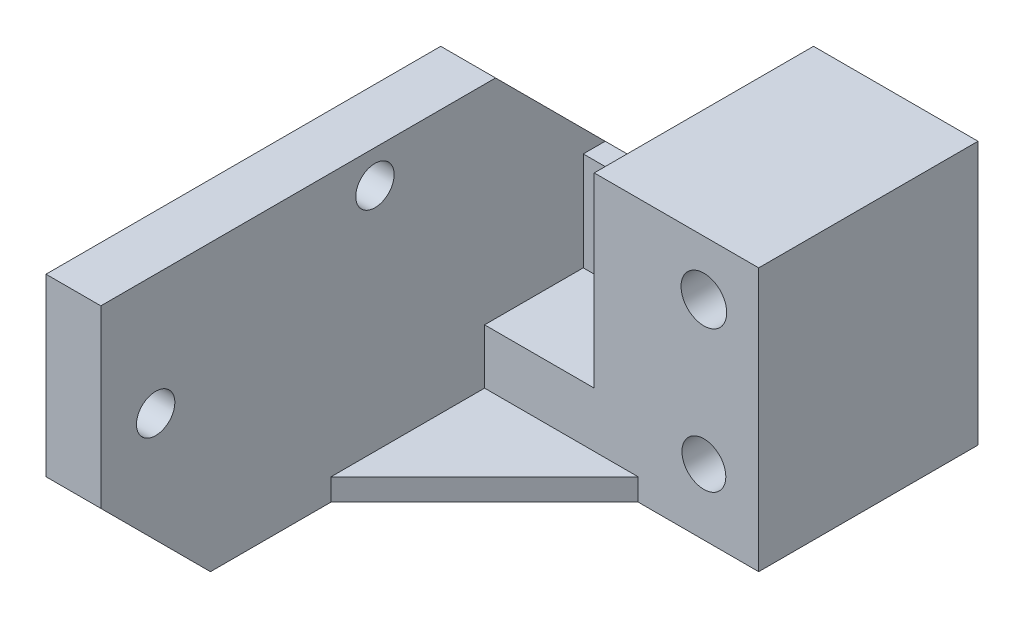
ISO-10303-21;
HEADER;
FILE_DESCRIPTION(('STEP AP214'),'2;1');
FILE_NAME('part.step','',(''),(''),'','','');
FILE_SCHEMA(('AUTOMOTIVE_DESIGN { 1 0 10303 214 1 1 1 1 }'));
ENDSEC;
DATA;
#1=APPLICATION_CONTEXT('core data for automotive mechanical design processes');
#2=APPLICATION_PROTOCOL_DEFINITION('international standard','automotive_design',2000,#1);
#3=PRODUCT_CONTEXT('',#1,'mechanical');
#4=PRODUCT('Part','Part','',(#3));
#5=PRODUCT_RELATED_PRODUCT_CATEGORY('part','',(#4));
#6=PRODUCT_DEFINITION_FORMATION('','',#4);
#7=PRODUCT_DEFINITION_CONTEXT('part definition',#1,'design');
#8=PRODUCT_DEFINITION('design','',#6,#7);
#9=PRODUCT_DEFINITION_SHAPE('','',#8);
#10=(LENGTH_UNIT() NAMED_UNIT(*) SI_UNIT(.MILLI.,.METRE.));
#11=(NAMED_UNIT(*) PLANE_ANGLE_UNIT() SI_UNIT($,.RADIAN.));
#12=(NAMED_UNIT(*) SI_UNIT($,.STERADIAN.) SOLID_ANGLE_UNIT());
#13=UNCERTAINTY_MEASURE_WITH_UNIT(LENGTH_MEASURE(1.E-05),#10,'distance_accuracy_value','');
#14=(GEOMETRIC_REPRESENTATION_CONTEXT(3) GLOBAL_UNCERTAINTY_ASSIGNED_CONTEXT((#13)) GLOBAL_UNIT_ASSIGNED_CONTEXT((#10,
#11,#12)) REPRESENTATION_CONTEXT('',''));
#15=CARTESIAN_POINT('',(0.,0.,0.));
#16=DIRECTION('',(0.,0.,1.));
#17=DIRECTION('',(1.,0.,0.));
#18=AXIS2_PLACEMENT_3D('',#15,#16,#17);
#19=CARTESIAN_POINT('',(30.,12.,0.));
#20=DIRECTION('',(0.,0.,-1.));
#21=DIRECTION('',(-1.,0.,0.));
#22=AXIS2_PLACEMENT_3D('',#19,#20,#21);
#23=PLANE('',#22);
#24=CARTESIAN_POINT('',(25.,19.,0.));
#25=DIRECTION('',(0.,0.,1.));
#26=DIRECTION('',(1.,0.,0.));
#27=AXIS2_PLACEMENT_3D('',#24,#25,#26);
#28=CIRCLE('',#27,2.08412794298633);
#29=CARTESIAN_POINT('',(27.0841279429863,19.,0.));
#30=VERTEX_POINT('',#29);
#31=EDGE_CURVE('E175',#30,#30,#28,.T.);
#32=ORIENTED_EDGE('',*,*,#31,.F.);
#33=EDGE_LOOP('',(#32));
#34=FACE_BOUND('',#33,.T.);
#35=CARTESIAN_POINT('',(25.,6.,0.));
#36=DIRECTION('',(0.,0.,1.));
#37=DIRECTION('',(1.,0.,0.));
#38=AXIS2_PLACEMENT_3D('',#35,#36,#37);
#39=CIRCLE('',#38,2.);
#40=CARTESIAN_POINT('',(27.,6.,0.));
#41=VERTEX_POINT('',#40);
#42=EDGE_CURVE('E183',#41,#41,#39,.T.);
#43=ORIENTED_EDGE('',*,*,#42,.F.);
#44=EDGE_LOOP('',(#43));
#45=FACE_BOUND('',#44,.T.);
#46=DIRECTION('',(0.,-1.,0.));
#47=VECTOR('',#46,1.);
#48=CARTESIAN_POINT('',(15.,24.,0.));
#49=LINE('',#48,#47);
#50=CARTESIAN_POINT('',(15.,24.,0.));
#51=VERTEX_POINT('',#50);
#52=CARTESIAN_POINT('',(15.,7.,0.));
#53=VERTEX_POINT('',#52);
#54=EDGE_CURVE('E174',#51,#53,#49,.T.);
#55=ORIENTED_EDGE('',*,*,#54,.T.);
#56=DIRECTION('',(-1.,0.,0.));
#57=VECTOR('',#56,1.);
#58=CARTESIAN_POINT('',(30.,7.,0.));
#59=LINE('',#58,#57);
#60=CARTESIAN_POINT('',(5.,7.,0.));
#61=VERTEX_POINT('',#60);
#62=EDGE_CURVE('E160',#53,#61,#59,.T.);
#63=ORIENTED_EDGE('',*,*,#62,.T.);
#64=DIRECTION('',(0.,-1.,0.));
#65=VECTOR('',#64,1.);
#66=CARTESIAN_POINT('',(5.,12.,0.));
#67=LINE('',#66,#65);
#68=CARTESIAN_POINT('',(5.,2.,0.));
#69=VERTEX_POINT('',#68);
#70=EDGE_CURVE('E171',#61,#69,#67,.T.);
#71=ORIENTED_EDGE('',*,*,#70,.T.);
#72=DIRECTION('',(1.,0.,0.));
#73=VECTOR('',#72,1.);
#74=CARTESIAN_POINT('',(19.,2.,0.));
#75=LINE('',#74,#73);
#76=CARTESIAN_POINT('',(19.,2.,0.));
#77=VERTEX_POINT('',#76);
#78=EDGE_CURVE('E291',#69,#77,#75,.T.);
#79=ORIENTED_EDGE('',*,*,#78,.T.);
#80=DIRECTION('',(0.,-1.,0.));
#81=VECTOR('',#80,1.);
#82=CARTESIAN_POINT('',(19.,2.,0.));
#83=LINE('',#82,#81);
#84=CARTESIAN_POINT('',(19.,0.,0.));
#85=VERTEX_POINT('',#84);
#86=EDGE_CURVE('E296',#77,#85,#83,.T.);
#87=ORIENTED_EDGE('',*,*,#86,.T.);
#88=DIRECTION('',(1.,0.,0.));
#89=VECTOR('',#88,1.);
#90=CARTESIAN_POINT('',(30.,0.,0.));
#91=LINE('',#90,#89);
#92=CARTESIAN_POINT('',(30.,0.,0.));
#93=VERTEX_POINT('',#92);
#94=EDGE_CURVE('E196',#85,#93,#91,.T.);
#95=ORIENTED_EDGE('',*,*,#94,.T.);
#96=DIRECTION('',(0.,-1.,0.));
#97=VECTOR('',#96,1.);
#98=CARTESIAN_POINT('',(30.,12.,0.));
#99=LINE('',#98,#97);
#100=CARTESIAN_POINT('',(30.,24.,0.));
#101=VERTEX_POINT('',#100);
#102=EDGE_CURVE('E212',#101,#93,#99,.T.);
#103=ORIENTED_EDGE('',*,*,#102,.F.);
#104=DIRECTION('',(1.,0.,0.));
#105=VECTOR('',#104,1.);
#106=CARTESIAN_POINT('',(15.,24.,0.));
#107=LINE('',#106,#105);
#108=EDGE_CURVE('E279',#51,#101,#107,.T.);
#109=ORIENTED_EDGE('',*,*,#108,.F.);
#110=EDGE_LOOP('',(#55,#63,#71,#79,#87,#95,#103,#109));
#111=FACE_BOUND('',#110,.T.);
#112=ADVANCED_FACE('F35',(#34,#45,#111),#23,.F.);
#113=CARTESIAN_POINT('',(30.,12.,-20.));
#114=DIRECTION('',(-1.,0.,0.));
#115=DIRECTION('',(0.,0.,1.));
#116=AXIS2_PLACEMENT_3D('',#113,#114,#115);
#117=PLANE('',#116);
#118=DIRECTION('',(0.,0.,-1.));
#119=VECTOR('',#118,1.);
#120=CARTESIAN_POINT('',(30.,0.,-20.));
#121=LINE('',#120,#119);
#122=CARTESIAN_POINT('',(30.,0.,-20.));
#123=VERTEX_POINT('',#122);
#124=EDGE_CURVE('E198',#93,#123,#121,.T.);
#125=ORIENTED_EDGE('',*,*,#124,.T.);
#126=DIRECTION('',(0.,-1.,0.));
#127=VECTOR('',#126,1.);
#128=CARTESIAN_POINT('',(30.,12.,-20.));
#129=LINE('',#128,#127);
#130=CARTESIAN_POINT('',(30.,24.,-20.));
#131=VERTEX_POINT('',#130);
#132=EDGE_CURVE('E209',#131,#123,#129,.T.);
#133=ORIENTED_EDGE('',*,*,#132,.F.);
#134=DIRECTION('',(0.,0.,-1.));
#135=VECTOR('',#134,1.);
#136=CARTESIAN_POINT('',(30.,24.,-20.));
#137=LINE('',#136,#135);
#138=EDGE_CURVE('E282',#101,#131,#137,.T.);
#139=ORIENTED_EDGE('',*,*,#138,.F.);
#140=ORIENTED_EDGE('',*,*,#102,.T.);
#141=EDGE_LOOP('',(#125,#133,#139,#140));
#142=FACE_BOUND('',#141,.T.);
#143=ADVANCED_FACE('F366',(#142),#117,.F.);
#144=CARTESIAN_POINT('',(15.,12.,-20.));
#145=DIRECTION('',(0.,0.,1.));
#146=DIRECTION('',(1.,0.,0.));
#147=AXIS2_PLACEMENT_3D('',#144,#145,#146);
#148=PLANE('',#147);
#149=CARTESIAN_POINT('',(25.,19.,-20.));
#150=DIRECTION('',(0.,0.,1.));
#151=DIRECTION('',(1.,0.,0.));
#152=AXIS2_PLACEMENT_3D('',#149,#150,#151);
#153=CIRCLE('',#152,2.08412794298633);
#154=CARTESIAN_POINT('',(27.0841279429863,19.,-20.));
#155=VERTEX_POINT('',#154);
#156=EDGE_CURVE('E271',#155,#155,#153,.T.);
#157=ORIENTED_EDGE('',*,*,#156,.T.);
#158=EDGE_LOOP('',(#157));
#159=FACE_BOUND('',#158,.T.);
#160=CARTESIAN_POINT('',(25.,6.,-20.));
#161=DIRECTION('',(0.,0.,1.));
#162=DIRECTION('',(1.,0.,0.));
#163=AXIS2_PLACEMENT_3D('',#160,#161,#162);
#164=CIRCLE('',#163,2.);
#165=CARTESIAN_POINT('',(27.,6.,-20.));
#166=VERTEX_POINT('',#165);
#167=EDGE_CURVE('E187',#166,#166,#164,.F.);
#168=ORIENTED_EDGE('',*,*,#167,.F.);
#169=EDGE_LOOP('',(#168));
#170=FACE_BOUND('',#169,.T.);
#171=DIRECTION('',(-1.,0.,0.));
#172=VECTOR('',#171,1.);
#173=CARTESIAN_POINT('',(15.,0.,-20.));
#174=LINE('',#173,#172);
#175=CARTESIAN_POINT('',(15.,0.,-20.));
#176=VERTEX_POINT('',#175);
#177=EDGE_CURVE('E200',#123,#176,#174,.T.);
#178=ORIENTED_EDGE('',*,*,#177,.T.);
#179=DIRECTION('',(0.,-1.,0.));
#180=VECTOR('',#179,1.);
#181=CARTESIAN_POINT('',(15.,12.,-20.));
#182=LINE('',#181,#180);
#183=CARTESIAN_POINT('',(15.,24.,-20.));
#184=VERTEX_POINT('',#183);
#185=EDGE_CURVE('E207',#184,#176,#182,.T.);
#186=ORIENTED_EDGE('',*,*,#185,.F.);
#187=DIRECTION('',(-1.,0.,0.));
#188=VECTOR('',#187,1.);
#189=CARTESIAN_POINT('',(15.,24.,-20.));
#190=LINE('',#189,#188);
#191=EDGE_CURVE('E285',#131,#184,#190,.T.);
#192=ORIENTED_EDGE('',*,*,#191,.F.);
#193=ORIENTED_EDGE('',*,*,#132,.T.);
#194=EDGE_LOOP('',(#178,#186,#192,#193));
#195=FACE_BOUND('',#194,.T.);
#196=ADVANCED_FACE('F372',(#159,#170,#195),#148,.F.);
#197=CARTESIAN_POINT('',(15.,12.,-11.));
#198=DIRECTION('',(1.,0.,0.));
#199=DIRECTION('',(0.,0.,-1.));
#200=AXIS2_PLACEMENT_3D('',#197,#198,#199);
#201=PLANE('',#200);
#202=DIRECTION('',(0.,0.,-1.));
#203=VECTOR('',#202,1.);
#204=CARTESIAN_POINT('',(15.,16.,-9.00000000000001));
#205=LINE('',#204,#203);
#206=CARTESIAN_POINT('',(15.,16.,-9.00000000000001));
#207=VERTEX_POINT('',#206);
#208=CARTESIAN_POINT('',(15.,16.,-11.));
#209=VERTEX_POINT('',#208);
#210=EDGE_CURVE('E266',#207,#209,#205,.T.);
#211=ORIENTED_EDGE('',*,*,#210,.F.);
#212=DIRECTION('',(0.,-1.,0.));
#213=VECTOR('',#212,1.);
#214=CARTESIAN_POINT('',(15.,16.,-9.00000000000001));
#215=LINE('',#214,#213);
#216=CARTESIAN_POINT('',(15.,7.,-9.00000000000001));
#217=VERTEX_POINT('',#216);
#218=EDGE_CURVE('E450',#207,#217,#215,.T.);
#219=ORIENTED_EDGE('',*,*,#218,.T.);
#220=DIRECTION('',(0.,0.,-1.));
#221=VECTOR('',#220,1.);
#222=CARTESIAN_POINT('',(15.,7.,35.));
#223=LINE('',#222,#221);
#224=EDGE_CURVE('E167',#53,#217,#223,.T.);
#225=ORIENTED_EDGE('',*,*,#224,.F.);
#226=ORIENTED_EDGE('',*,*,#54,.F.);
#227=DIRECTION('',(0.,0.,1.));
#228=VECTOR('',#227,1.);
#229=CARTESIAN_POINT('',(15.,24.,-20.));
#230=LINE('',#229,#228);
#231=EDGE_CURVE('E274',#184,#51,#230,.T.);
#232=ORIENTED_EDGE('',*,*,#231,.F.);
#233=ORIENTED_EDGE('',*,*,#185,.T.);
#234=DIRECTION('',(0.,0.,1.));
#235=VECTOR('',#234,1.);
#236=CARTESIAN_POINT('',(15.,0.,-11.));
#237=LINE('',#236,#235);
#238=CARTESIAN_POINT('',(15.,0.,-6.99999999999999));
#239=VERTEX_POINT('',#238);
#240=EDGE_CURVE('E50',#176,#239,#237,.T.);
#241=ORIENTED_EDGE('',*,*,#240,.T.);
#242=DIRECTION('',(0.,0.707106781186546,-0.707106781186549));
#243=VECTOR('',#242,1.);
#244=CARTESIAN_POINT('',(15.,7.99999999999999,-15.));
#245=LINE('',#244,#243);
#246=CARTESIAN_POINT('',(15.,4.,-11.));
#247=VERTEX_POINT('',#246);
#248=EDGE_CURVE('E11',#239,#247,#245,.T.);
#249=ORIENTED_EDGE('',*,*,#248,.T.);
#250=DIRECTION('',(0.,-1.,0.));
#251=VECTOR('',#250,1.);
#252=CARTESIAN_POINT('',(15.,12.,-11.));
#253=LINE('',#252,#251);
#254=EDGE_CURVE('E205',#209,#247,#253,.T.);
#255=ORIENTED_EDGE('',*,*,#254,.F.);
#256=EDGE_LOOP('',(#211,#219,#225,#226,#232,#233,#241,#249,#255));
#257=FACE_BOUND('',#256,.T.);
#258=ADVANCED_FACE('F250',(#257),#201,.F.);
#259=CARTESIAN_POINT('',(0.,12.,-11.));
#260=DIRECTION('',(0.,0.,1.));
#261=DIRECTION('',(1.,0.,0.));
#262=AXIS2_PLACEMENT_3D('',#259,#260,#261);
#263=PLANE('',#262);
#264=DIRECTION('',(-1.,0.,0.));
#265=VECTOR('',#264,1.);
#266=CARTESIAN_POINT('',(0.,4.,-11.));
#267=LINE('',#266,#265);
#268=CARTESIAN_POINT('',(4.00000000000001,4.,-11.));
#269=VERTEX_POINT('',#268);
#270=EDGE_CURVE('E58',#247,#269,#267,.T.);
#271=ORIENTED_EDGE('',*,*,#270,.T.);
#272=DIRECTION('',(0.,1.,0.));
#273=VECTOR('',#272,1.);
#274=CARTESIAN_POINT('',(4.00000000000001,12.,-11.));
#275=LINE('',#274,#273);
#276=CARTESIAN_POINT('',(4.00000000000001,16.,-11.));
#277=VERTEX_POINT('',#276);
#278=EDGE_CURVE('E238',#269,#277,#275,.T.);
#279=ORIENTED_EDGE('',*,*,#278,.T.);
#280=DIRECTION('',(1.,0.,0.));
#281=VECTOR('',#280,1.);
#282=CARTESIAN_POINT('',(5.,16.,-11.));
#283=LINE('',#282,#281);
#284=CARTESIAN_POINT('',(5.,16.,-11.));
#285=VERTEX_POINT('',#284);
#286=EDGE_CURVE('E221',#277,#285,#283,.T.);
#287=ORIENTED_EDGE('',*,*,#286,.T.);
#288=DIRECTION('',(1.,0.,0.));
#289=VECTOR('',#288,1.);
#290=CARTESIAN_POINT('',(5.,16.,-11.));
#291=LINE('',#290,#289);
#292=EDGE_CURVE('E255',#285,#209,#291,.T.);
#293=ORIENTED_EDGE('',*,*,#292,.T.);
#294=ORIENTED_EDGE('',*,*,#254,.T.);
#295=EDGE_LOOP('',(#271,#279,#287,#293,#294));
#296=FACE_BOUND('',#295,.T.);
#297=ADVANCED_FACE('F253',(#296),#263,.F.);
#298=CARTESIAN_POINT('',(0.,12.,0.));
#299=DIRECTION('',(1.,0.,0.));
#300=DIRECTION('',(0.,0.,-1.));
#301=AXIS2_PLACEMENT_3D('',#298,#299,#300);
#302=PLANE('',#301);
#303=DIRECTION('',(0.,-0.707106781186549,-0.707106781186546));
#304=VECTOR('',#303,1.);
#305=CARTESIAN_POINT('',(0.,26.,-1.00000000000001));
#306=LINE('',#305,#304);
#307=CARTESIAN_POINT('',(0.,26.,-1.00000000000001));
#308=VERTEX_POINT('',#307);
#309=CARTESIAN_POINT('',(0.,20.,-6.99999999999999));
#310=VERTEX_POINT('',#309);
#311=EDGE_CURVE('E218',#308,#310,#306,.T.);
#312=ORIENTED_EDGE('',*,*,#311,.T.);
#313=DIRECTION('',(0.,-1.,0.));
#314=VECTOR('',#313,1.);
#315=CARTESIAN_POINT('',(0.,12.,-6.99999999999999));
#316=LINE('',#315,#314);
#317=CARTESIAN_POINT('',(0.,0.,-6.99999999999999));
#318=VERTEX_POINT('',#317);
#319=EDGE_CURVE('E234',#310,#318,#316,.T.);
#320=ORIENTED_EDGE('',*,*,#319,.T.);
#321=DIRECTION('',(0.,0.,1.));
#322=VECTOR('',#321,1.);
#323=CARTESIAN_POINT('',(0.,0.,0.));
#324=LINE('',#323,#322);
#325=CARTESIAN_POINT('',(0.,0.,25.));
#326=VERTEX_POINT('',#325);
#327=EDGE_CURVE('E203',#318,#326,#324,.T.);
#328=ORIENTED_EDGE('',*,*,#327,.T.);
#329=DIRECTION('',(0.,-0.707106781186549,-0.707106781186546));
#330=VECTOR('',#329,1.);
#331=CARTESIAN_POINT('',(0.,0.,25.));
#332=LINE('',#331,#330);
#333=CARTESIAN_POINT('',(0.,10.,35.));
#334=VERTEX_POINT('',#333);
#335=EDGE_CURVE('E228',#326,#334,#332,.F.);
#336=ORIENTED_EDGE('',*,*,#335,.T.);
#337=DIRECTION('',(0.,1.,0.));
#338=VECTOR('',#337,1.);
#339=CARTESIAN_POINT('',(0.,0.,35.));
#340=LINE('',#339,#338);
#341=CARTESIAN_POINT('',(0.,26.,35.));
#342=VERTEX_POINT('',#341);
#343=EDGE_CURVE('E313',#334,#342,#340,.T.);
#344=ORIENTED_EDGE('',*,*,#343,.T.);
#345=DIRECTION('',(0.,0.,-1.));
#346=VECTOR('',#345,1.);
#347=CARTESIAN_POINT('',(0.,26.,-11.));
#348=LINE('',#347,#346);
#349=EDGE_CURVE('E320',#342,#308,#348,.T.);
#350=ORIENTED_EDGE('',*,*,#349,.T.);
#351=EDGE_LOOP('',(#312,#320,#328,#336,#344,#350));
#352=FACE_BOUND('',#351,.T.);
#353=CARTESIAN_POINT('',(0.,23.,10.));
#354=DIRECTION('',(-1.,0.,0.));
#355=DIRECTION('',(0.,0.,1.));
#356=AXIS2_PLACEMENT_3D('',#353,#354,#355);
#357=CIRCLE('',#356,1.75);
#358=CARTESIAN_POINT('',(0.,23.,11.75));
#359=VERTEX_POINT('',#358);
#360=EDGE_CURVE('E301',#359,#359,#357,.T.);
#361=ORIENTED_EDGE('',*,*,#360,.F.);
#362=EDGE_LOOP('',(#361));
#363=FACE_BOUND('',#362,.T.);
#364=CARTESIAN_POINT('',(0.,15.,30.));
#365=DIRECTION('',(-1.,0.,0.));
#366=DIRECTION('',(0.,0.,1.));
#367=AXIS2_PLACEMENT_3D('',#364,#365,#366);
#368=CIRCLE('',#367,1.75);
#369=CARTESIAN_POINT('',(0.,15.,31.75));
#370=VERTEX_POINT('',#369);
#371=EDGE_CURVE('E307',#370,#370,#368,.T.);
#372=ORIENTED_EDGE('',*,*,#371,.F.);
#373=EDGE_LOOP('',(#372));
#374=FACE_BOUND('',#373,.T.);
#375=ADVANCED_FACE('F327',(#352,#363,#374),#302,.F.);
#376=CARTESIAN_POINT('',(0.,0.,0.));
#377=DIRECTION('',(0.,-1.,0.));
#378=DIRECTION('',(0.,0.,-1.));
#379=AXIS2_PLACEMENT_3D('',#376,#377,#378);
#380=PLANE('',#379);
#381=ORIENTED_EDGE('',*,*,#327,.F.);
#382=DIRECTION('',(1.,0.,0.));
#383=VECTOR('',#382,1.);
#384=CARTESIAN_POINT('',(15.,0.,-6.99999999999999));
#385=LINE('',#384,#383);
#386=EDGE_CURVE('E44',#318,#239,#385,.T.);
#387=ORIENTED_EDGE('',*,*,#386,.T.);
#388=ORIENTED_EDGE('',*,*,#240,.F.);
#389=ORIENTED_EDGE('',*,*,#177,.F.);
#390=ORIENTED_EDGE('',*,*,#124,.F.);
#391=ORIENTED_EDGE('',*,*,#94,.F.);
#392=DIRECTION('',(-0.707106781186547,0.,0.707106781186547));
#393=VECTOR('',#392,1.);
#394=CARTESIAN_POINT('',(5.,0.,14.));
#395=LINE('',#394,#393);
#396=CARTESIAN_POINT('',(5.,0.,14.));
#397=VERTEX_POINT('',#396);
#398=EDGE_CURVE('E289',#85,#397,#395,.T.);
#399=ORIENTED_EDGE('',*,*,#398,.T.);
#400=DIRECTION('',(0.,0.,1.));
#401=VECTOR('',#400,1.);
#402=CARTESIAN_POINT('',(5.,0.,-11.));
#403=LINE('',#402,#401);
#404=CARTESIAN_POINT('',(4.99999999999999,0.,25.));
#405=VERTEX_POINT('',#404);
#406=EDGE_CURVE('E316',#397,#405,#403,.T.);
#407=ORIENTED_EDGE('',*,*,#406,.T.);
#408=DIRECTION('',(-1.,0.,0.));
#409=VECTOR('',#408,1.);
#410=CARTESIAN_POINT('',(0.,0.,25.));
#411=LINE('',#410,#409);
#412=EDGE_CURVE('E225',#405,#326,#411,.T.);
#413=ORIENTED_EDGE('',*,*,#412,.T.);
#414=EDGE_LOOP('',(#381,#387,#388,#389,#390,#391,#399,#407,#413));
#415=FACE_BOUND('',#414,.T.);
#416=ADVANCED_FACE('F246',(#415),#380,.T.);
#417=CARTESIAN_POINT('',(25.,6.,-20.001));
#418=DIRECTION('',(0.,0.,1.));
#419=DIRECTION('',(1.,0.,0.));
#420=AXIS2_PLACEMENT_3D('',#417,#418,#419);
#421=CYLINDRICAL_SURFACE('',#420,2.);
#422=ORIENTED_EDGE('',*,*,#42,.T.);
#423=EDGE_LOOP('',(#422));
#424=FACE_BOUND('',#423,.T.);
#425=ORIENTED_EDGE('',*,*,#167,.T.);
#426=EDGE_LOOP('',(#425));
#427=FACE_BOUND('',#426,.T.);
#428=ADVANCED_FACE('F420',(#424,#427),#421,.F.);
#429=CARTESIAN_POINT('',(5.,0.,0.));
#430=DIRECTION('',(1.,0.,0.));
#431=DIRECTION('',(0.,0.,-1.));
#432=AXIS2_PLACEMENT_3D('',#429,#430,#431);
#433=PLANE('',#432);
#434=DIRECTION('',(0.,0.,-1.));
#435=VECTOR('',#434,1.);
#436=CARTESIAN_POINT('',(5.,16.,-9.00000000000001));
#437=LINE('',#436,#435);
#438=CARTESIAN_POINT('',(5.,16.,-9.00000000000001));
#439=VERTEX_POINT('',#438);
#440=EDGE_CURVE('E268',#439,#285,#437,.T.);
#441=ORIENTED_EDGE('',*,*,#440,.T.);
#442=DIRECTION('',(0.,0.707106781186549,0.707106781186546));
#443=VECTOR('',#442,1.);
#444=CARTESIAN_POINT('',(5.,13.5,-13.5));
#445=LINE('',#444,#443);
#446=CARTESIAN_POINT('',(5.,26.,-1.00000000000001));
#447=VERTEX_POINT('',#446);
#448=EDGE_CURVE('E223',#285,#447,#445,.T.);
#449=ORIENTED_EDGE('',*,*,#448,.T.);
#450=DIRECTION('',(0.,0.,-1.));
#451=VECTOR('',#450,1.);
#452=CARTESIAN_POINT('',(5.,26.,-11.));
#453=LINE('',#452,#451);
#454=CARTESIAN_POINT('',(4.99999999999999,26.,35.));
#455=VERTEX_POINT('',#454);
#456=EDGE_CURVE('E190',#455,#447,#453,.T.);
#457=ORIENTED_EDGE('',*,*,#456,.F.);
#458=DIRECTION('',(0.,1.,0.));
#459=VECTOR('',#458,1.);
#460=CARTESIAN_POINT('',(4.99999999999999,0.,35.));
#461=LINE('',#460,#459);
#462=CARTESIAN_POINT('',(4.99999999999999,10.,35.));
#463=VERTEX_POINT('',#462);
#464=EDGE_CURVE('E319',#463,#455,#461,.T.);
#465=ORIENTED_EDGE('',*,*,#464,.F.);
#466=DIRECTION('',(0.,0.707106781186549,0.707106781186546));
#467=VECTOR('',#466,1.);
#468=CARTESIAN_POINT('',(5.,-12.5,12.5000000000001));
#469=LINE('',#468,#467);
#470=EDGE_CURVE('E232',#463,#405,#469,.F.);
#471=ORIENTED_EDGE('',*,*,#470,.T.);
#472=ORIENTED_EDGE('',*,*,#406,.F.);
#473=DIRECTION('',(0.,-1.,0.));
#474=VECTOR('',#473,1.);
#475=CARTESIAN_POINT('',(5.,2.,14.));
#476=LINE('',#475,#474);
#477=CARTESIAN_POINT('',(5.,2.,14.));
#478=VERTEX_POINT('',#477);
#479=EDGE_CURVE('E298',#478,#397,#476,.T.);
#480=ORIENTED_EDGE('',*,*,#479,.F.);
#481=DIRECTION('',(0.,0.,-1.));
#482=VECTOR('',#481,1.);
#483=CARTESIAN_POINT('',(5.,2.,0.));
#484=LINE('',#483,#482);
#485=EDGE_CURVE('E182',#478,#69,#484,.T.);
#486=ORIENTED_EDGE('',*,*,#485,.T.);
#487=ORIENTED_EDGE('',*,*,#70,.F.);
#488=DIRECTION('',(0.,0.,-1.));
#489=VECTOR('',#488,1.);
#490=CARTESIAN_POINT('',(4.99999999999999,7.,35.));
#491=LINE('',#490,#489);
#492=CARTESIAN_POINT('',(5.,7.,-9.00000000000001));
#493=VERTEX_POINT('',#492);
#494=EDGE_CURVE('E156',#61,#493,#491,.T.);
#495=ORIENTED_EDGE('',*,*,#494,.T.);
#496=DIRECTION('',(0.,1.,0.));
#497=VECTOR('',#496,1.);
#498=CARTESIAN_POINT('',(5.,16.,-9.00000000000001));
#499=LINE('',#498,#497);
#500=EDGE_CURVE('E259',#493,#439,#499,.T.);
#501=ORIENTED_EDGE('',*,*,#500,.T.);
#502=EDGE_LOOP('',(#441,#449,#457,#465,#471,#472,#480,#486,#487,#495,#501));
#503=FACE_BOUND('',#502,.T.);
#504=CARTESIAN_POINT('',(4.99999999999999,15.,30.));
#505=DIRECTION('',(-1.,0.,0.));
#506=DIRECTION('',(0.,0.,1.));
#507=AXIS2_PLACEMENT_3D('',#504,#505,#506);
#508=CIRCLE('',#507,1.75);
#509=CARTESIAN_POINT('',(4.99999999999999,15.,31.75));
#510=VERTEX_POINT('',#509);
#511=EDGE_CURVE('E310',#510,#510,#508,.T.);
#512=ORIENTED_EDGE('',*,*,#511,.T.);
#513=EDGE_LOOP('',(#512));
#514=FACE_BOUND('',#513,.T.);
#515=CARTESIAN_POINT('',(5.,23.,10.));
#516=DIRECTION('',(-1.,0.,0.));
#517=DIRECTION('',(0.,0.,1.));
#518=AXIS2_PLACEMENT_3D('',#515,#516,#517);
#519=CIRCLE('',#518,1.75);
#520=CARTESIAN_POINT('',(5.,23.,11.75));
#521=VERTEX_POINT('',#520);
#522=EDGE_CURVE('E304',#521,#521,#519,.T.);
#523=ORIENTED_EDGE('',*,*,#522,.T.);
#524=EDGE_LOOP('',(#523));
#525=FACE_BOUND('',#524,.T.);
#526=ADVANCED_FACE('F179',(#503,#514,#525),#433,.T.);
#527=CARTESIAN_POINT('',(5.,26.,-11.));
#528=DIRECTION('',(0.,1.,0.));
#529=DIRECTION('',(0.,0.,1.));
#530=AXIS2_PLACEMENT_3D('',#527,#528,#529);
#531=PLANE('',#530);
#532=ORIENTED_EDGE('',*,*,#456,.T.);
#533=DIRECTION('',(-1.,0.,0.));
#534=VECTOR('',#533,1.);
#535=CARTESIAN_POINT('',(0.,26.,-1.00000000000001));
#536=LINE('',#535,#534);
#537=EDGE_CURVE('E215',#447,#308,#536,.T.);
#538=ORIENTED_EDGE('',*,*,#537,.T.);
#539=ORIENTED_EDGE('',*,*,#349,.F.);
#540=DIRECTION('',(-1.,0.,0.));
#541=VECTOR('',#540,1.);
#542=CARTESIAN_POINT('',(4.99999999999999,26.,35.));
#543=LINE('',#542,#541);
#544=EDGE_CURVE('E184',#455,#342,#543,.T.);
#545=ORIENTED_EDGE('',*,*,#544,.F.);
#546=EDGE_LOOP('',(#532,#538,#539,#545));
#547=FACE_BOUND('',#546,.T.);
#548=ADVANCED_FACE('F333',(#547),#531,.T.);
#549=CARTESIAN_POINT('',(4.99999999999999,0.,35.));
#550=DIRECTION('',(0.,0.,1.));
#551=DIRECTION('',(1.,0.,0.));
#552=AXIS2_PLACEMENT_3D('',#549,#550,#551);
#553=PLANE('',#552);
#554=ORIENTED_EDGE('',*,*,#343,.F.);
#555=DIRECTION('',(1.,0.,0.));
#556=VECTOR('',#555,1.);
#557=CARTESIAN_POINT('',(4.99999999999999,10.,35.));
#558=LINE('',#557,#556);
#559=EDGE_CURVE('E230',#334,#463,#558,.T.);
#560=ORIENTED_EDGE('',*,*,#559,.T.);
#561=ORIENTED_EDGE('',*,*,#464,.T.);
#562=ORIENTED_EDGE('',*,*,#544,.T.);
#563=EDGE_LOOP('',(#554,#560,#561,#562));
#564=FACE_BOUND('',#563,.T.);
#565=ADVANCED_FACE('F352',(#564),#553,.T.);
#566=CARTESIAN_POINT('',(4.99999999999999,15.,30.));
#567=DIRECTION('',(-1.,0.,0.));
#568=DIRECTION('',(0.,0.,1.));
#569=AXIS2_PLACEMENT_3D('',#566,#567,#568);
#570=CYLINDRICAL_SURFACE('',#569,1.75);
#571=ORIENTED_EDGE('',*,*,#511,.F.);
#572=EDGE_LOOP('',(#571));
#573=FACE_BOUND('',#572,.T.);
#574=ORIENTED_EDGE('',*,*,#371,.T.);
#575=EDGE_LOOP('',(#574));
#576=FACE_BOUND('',#575,.T.);
#577=ADVANCED_FACE('F354',(#573,#576),#570,.F.);
#578=CARTESIAN_POINT('',(5.,23.,10.));
#579=DIRECTION('',(-1.,0.,0.));
#580=DIRECTION('',(0.,0.,1.));
#581=AXIS2_PLACEMENT_3D('',#578,#579,#580);
#582=CYLINDRICAL_SURFACE('',#581,1.75);
#583=ORIENTED_EDGE('',*,*,#522,.F.);
#584=EDGE_LOOP('',(#583));
#585=FACE_BOUND('',#584,.T.);
#586=ORIENTED_EDGE('',*,*,#360,.T.);
#587=EDGE_LOOP('',(#586));
#588=FACE_BOUND('',#587,.T.);
#589=ADVANCED_FACE('F360',(#585,#588),#582,.F.);
#590=CARTESIAN_POINT('',(5.,26.,-1.00000000000001));
#591=DIRECTION('',(0.,0.707106781186546,-0.707106781186549));
#592=DIRECTION('',(1.,0.,0.));
#593=AXIS2_PLACEMENT_3D('',#590,#591,#592);
#594=PLANE('',#593);
#595=ORIENTED_EDGE('',*,*,#286,.F.);
#596=DIRECTION('',(0.577350269189624,-0.577350269189628,-0.577350269189626));
#597=VECTOR('',#596,1.);
#598=CARTESIAN_POINT('',(-2.33333333333333,22.3333333333333,-4.66666666666665));
#599=LINE('',#598,#597);
#600=EDGE_CURVE('E240',#277,#310,#599,.F.);
#601=ORIENTED_EDGE('',*,*,#600,.T.);
#602=ORIENTED_EDGE('',*,*,#311,.F.);
#603=ORIENTED_EDGE('',*,*,#537,.F.);
#604=ORIENTED_EDGE('',*,*,#448,.F.);
#605=EDGE_LOOP('',(#595,#601,#602,#603,#604));
#606=FACE_BOUND('',#605,.T.);
#607=ADVANCED_FACE('F338',(#606),#594,.T.);
#608=CARTESIAN_POINT('',(5.,2.,14.));
#609=DIRECTION('',(0.707106781186547,0.,0.707106781186547));
#610=DIRECTION('',(0.707106781186548,0.,-0.707106781186548));
#611=AXIS2_PLACEMENT_3D('',#608,#609,#610);
#612=PLANE('',#611);
#613=ORIENTED_EDGE('',*,*,#398,.F.);
#614=ORIENTED_EDGE('',*,*,#86,.F.);
#615=DIRECTION('',(-0.707106781186547,0.,0.707106781186547));
#616=VECTOR('',#615,1.);
#617=CARTESIAN_POINT('',(5.,2.,14.));
#618=LINE('',#617,#616);
#619=EDGE_CURVE('E293',#77,#478,#618,.T.);
#620=ORIENTED_EDGE('',*,*,#619,.T.);
#621=ORIENTED_EDGE('',*,*,#479,.T.);
#622=EDGE_LOOP('',(#613,#614,#620,#621));
#623=FACE_BOUND('',#622,.T.);
#624=ADVANCED_FACE('F381',(#623),#612,.T.);
#625=CARTESIAN_POINT('',(0.,2.,0.));
#626=DIRECTION('',(0.,-1.,0.));
#627=DIRECTION('',(0.,0.,-1.));
#628=AXIS2_PLACEMENT_3D('',#625,#626,#627);
#629=PLANE('',#628);
#630=ORIENTED_EDGE('',*,*,#485,.F.);
#631=ORIENTED_EDGE('',*,*,#619,.F.);
#632=ORIENTED_EDGE('',*,*,#78,.F.);
#633=EDGE_LOOP('',(#630,#631,#632));
#634=FACE_BOUND('',#633,.T.);
#635=ADVANCED_FACE('F384',(#634),#629,.F.);
#636=CARTESIAN_POINT('',(0.,0.,25.));
#637=DIRECTION('',(0.,0.707106781186546,-0.707106781186549));
#638=DIRECTION('',(-1.,0.,0.));
#639=AXIS2_PLACEMENT_3D('',#636,#637,#638);
#640=PLANE('',#639);
#641=ORIENTED_EDGE('',*,*,#470,.F.);
#642=ORIENTED_EDGE('',*,*,#559,.F.);
#643=ORIENTED_EDGE('',*,*,#335,.F.);
#644=ORIENTED_EDGE('',*,*,#412,.F.);
#645=EDGE_LOOP('',(#641,#642,#643,#644));
#646=FACE_BOUND('',#645,.T.);
#647=ADVANCED_FACE('F347',(#646),#640,.F.);
#648=CARTESIAN_POINT('',(0.,24.,0.));
#649=DIRECTION('',(0.,1.,0.));
#650=DIRECTION('',(0.,0.,1.));
#651=AXIS2_PLACEMENT_3D('',#648,#649,#650);
#652=PLANE('',#651);
#653=ORIENTED_EDGE('',*,*,#231,.T.);
#654=ORIENTED_EDGE('',*,*,#108,.T.);
#655=ORIENTED_EDGE('',*,*,#138,.T.);
#656=ORIENTED_EDGE('',*,*,#191,.T.);
#657=EDGE_LOOP('',(#653,#654,#655,#656));
#658=FACE_BOUND('',#657,.T.);
#659=ADVANCED_FACE('F383',(#658),#652,.T.);
#660=CARTESIAN_POINT('',(25.,19.,-20.));
#661=DIRECTION('',(0.,0.,1.));
#662=DIRECTION('',(1.,0.,0.));
#663=AXIS2_PLACEMENT_3D('',#660,#661,#662);
#664=CYLINDRICAL_SURFACE('',#663,2.08412794298633);
#665=ORIENTED_EDGE('',*,*,#156,.F.);
#666=EDGE_LOOP('',(#665));
#667=FACE_BOUND('',#666,.T.);
#668=ORIENTED_EDGE('',*,*,#31,.T.);
#669=EDGE_LOOP('',(#668));
#670=FACE_BOUND('',#669,.T.);
#671=ADVANCED_FACE('F403',(#667,#670),#664,.F.);
#672=CARTESIAN_POINT('',(15.,7.,35.));
#673=DIRECTION('',(0.,-1.,0.));
#674=DIRECTION('',(0.,0.,-1.));
#675=AXIS2_PLACEMENT_3D('',#672,#673,#674);
#676=PLANE('',#675);
#677=ORIENTED_EDGE('',*,*,#224,.T.);
#678=DIRECTION('',(-1.,0.,0.));
#679=VECTOR('',#678,1.);
#680=CARTESIAN_POINT('',(5.,7.,-9.00000000000001));
#681=LINE('',#680,#679);
#682=EDGE_CURVE('E163',#217,#493,#681,.T.);
#683=ORIENTED_EDGE('',*,*,#682,.T.);
#684=ORIENTED_EDGE('',*,*,#494,.F.);
#685=ORIENTED_EDGE('',*,*,#62,.F.);
#686=EDGE_LOOP('',(#677,#683,#684,#685));
#687=FACE_BOUND('',#686,.T.);
#688=ADVANCED_FACE('F159',(#687),#676,.F.);
#689=CARTESIAN_POINT('',(5.,16.,-9.00000000000001));
#690=DIRECTION('',(0.,1.,0.));
#691=DIRECTION('',(0.,0.,1.));
#692=AXIS2_PLACEMENT_3D('',#689,#690,#691);
#693=PLANE('',#692);
#694=ORIENTED_EDGE('',*,*,#292,.F.);
#695=ORIENTED_EDGE('',*,*,#440,.F.);
#696=DIRECTION('',(1.,0.,0.));
#697=VECTOR('',#696,1.);
#698=CARTESIAN_POINT('',(5.,16.,-9.00000000000001));
#699=LINE('',#698,#697);
#700=EDGE_CURVE('E261',#439,#207,#699,.T.);
#701=ORIENTED_EDGE('',*,*,#700,.T.);
#702=ORIENTED_EDGE('',*,*,#210,.T.);
#703=EDGE_LOOP('',(#694,#695,#701,#702));
#704=FACE_BOUND('',#703,.T.);
#705=ADVANCED_FACE('F393',(#704),#693,.T.);
#706=CARTESIAN_POINT('',(0.,0.,-9.00000000000001));
#707=DIRECTION('',(0.,0.,1.));
#708=DIRECTION('',(1.,0.,0.));
#709=AXIS2_PLACEMENT_3D('',#706,#707,#708);
#710=PLANE('',#709);
#711=ORIENTED_EDGE('',*,*,#500,.F.);
#712=ORIENTED_EDGE('',*,*,#682,.F.);
#713=ORIENTED_EDGE('',*,*,#218,.F.);
#714=ORIENTED_EDGE('',*,*,#700,.F.);
#715=EDGE_LOOP('',(#711,#712,#713,#714));
#716=FACE_BOUND('',#715,.T.);
#717=ADVANCED_FACE('F389',(#716),#710,.T.);
#718=CARTESIAN_POINT('',(0.,4.,-11.));
#719=DIRECTION('',(0.,-0.707106781186549,-0.707106781186546));
#720=DIRECTION('',(1.,0.,0.));
#721=AXIS2_PLACEMENT_3D('',#718,#719,#720);
#722=PLANE('',#721);
#723=ORIENTED_EDGE('',*,*,#248,.F.);
#724=ORIENTED_EDGE('',*,*,#386,.F.);
#725=DIRECTION('',(-0.577350269189625,-0.577350269189625,0.577350269189627));
#726=VECTOR('',#725,1.);
#727=CARTESIAN_POINT('',(2.66666666666667,2.66666666666667,-9.66666666666667));
#728=LINE('',#727,#726);
#729=EDGE_CURVE('E39',#269,#318,#728,.T.);
#730=ORIENTED_EDGE('',*,*,#729,.F.);
#731=ORIENTED_EDGE('',*,*,#270,.F.);
#732=EDGE_LOOP('',(#723,#724,#730,#731));
#733=FACE_BOUND('',#732,.T.);
#734=ADVANCED_FACE('F37',(#733),#722,.T.);
#735=CARTESIAN_POINT('',(0.,12.,-6.99999999999999));
#736=DIRECTION('',(0.707106781186549,0.,0.707106781186546));
#737=DIRECTION('',(0.,-1.,0.));
#738=AXIS2_PLACEMENT_3D('',#735,#736,#737);
#739=PLANE('',#738);
#740=ORIENTED_EDGE('',*,*,#600,.F.);
#741=ORIENTED_EDGE('',*,*,#278,.F.);
#742=ORIENTED_EDGE('',*,*,#729,.T.);
#743=ORIENTED_EDGE('',*,*,#319,.F.);
#744=EDGE_LOOP('',(#740,#741,#742,#743));
#745=FACE_BOUND('',#744,.T.);
#746=ADVANCED_FACE('F341',(#745),#739,.F.);
#747=CLOSED_SHELL('',(#112,#143,#196,#258,#297,#375,#416,#428,#526,#548,#565,#577,#589,#607,
#624,#635,#647,#659,#671,#688,#705,#717,#734,#746));
#748=MANIFOLD_SOLID_BREP('B2',#747);
#749=ADVANCED_BREP_SHAPE_REPRESENTATION('',(#18,#748),#14);
#750=SHAPE_DEFINITION_REPRESENTATION(#9,#749);
ENDSEC;
END-ISO-10303-21;
